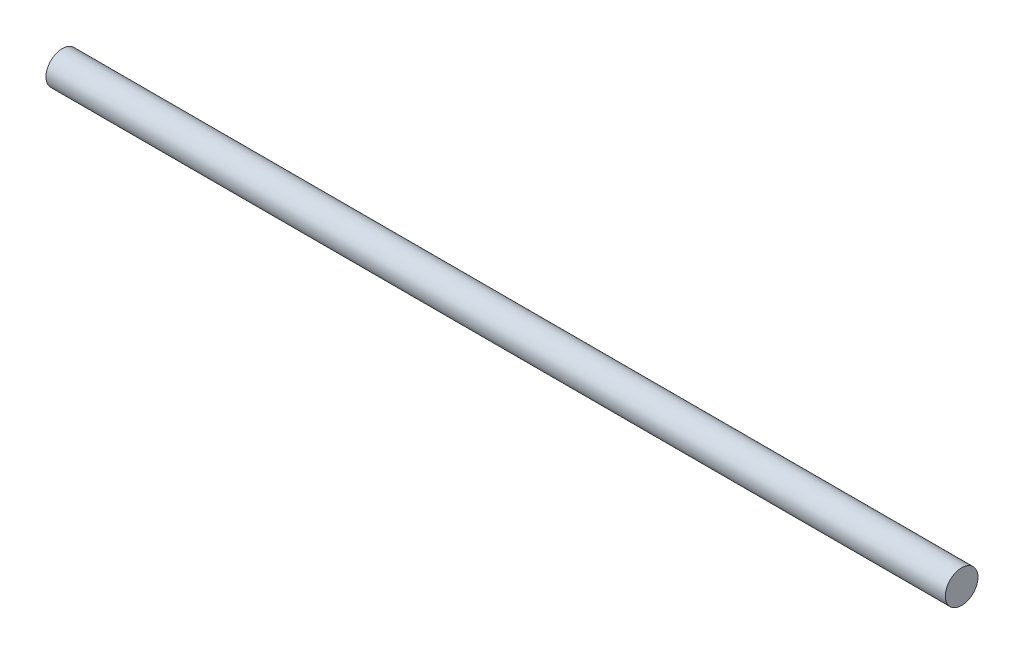
ISO-10303-21;
HEADER;
FILE_DESCRIPTION(('STEP AP214'),'2;1');
FILE_NAME('part.step','',(''),(''),'','','');
FILE_SCHEMA(('AUTOMOTIVE_DESIGN { 1 0 10303 214 1 1 1 1 }'));
ENDSEC;
DATA;
#1=APPLICATION_CONTEXT('core data for automotive mechanical design processes');
#2=APPLICATION_PROTOCOL_DEFINITION('international standard','automotive_design',2000,#1);
#3=PRODUCT_CONTEXT('',#1,'mechanical');
#4=PRODUCT('Part','Part','',(#3));
#5=PRODUCT_RELATED_PRODUCT_CATEGORY('part','',(#4));
#6=PRODUCT_DEFINITION_FORMATION('','',#4);
#7=PRODUCT_DEFINITION_CONTEXT('part definition',#1,'design');
#8=PRODUCT_DEFINITION('design','',#6,#7);
#9=PRODUCT_DEFINITION_SHAPE('','',#8);
#10=(LENGTH_UNIT() NAMED_UNIT(*) SI_UNIT(.MILLI.,.METRE.));
#11=(NAMED_UNIT(*) PLANE_ANGLE_UNIT() SI_UNIT($,.RADIAN.));
#12=(NAMED_UNIT(*) SI_UNIT($,.STERADIAN.) SOLID_ANGLE_UNIT());
#13=UNCERTAINTY_MEASURE_WITH_UNIT(LENGTH_MEASURE(1.E-05),#10,'distance_accuracy_value','');
#14=(GEOMETRIC_REPRESENTATION_CONTEXT(3) GLOBAL_UNCERTAINTY_ASSIGNED_CONTEXT((#13)) GLOBAL_UNIT_ASSIGNED_CONTEXT((#10,
#11,#12)) REPRESENTATION_CONTEXT('',''));
#15=CARTESIAN_POINT('',(0.,0.,0.));
#16=DIRECTION('',(0.,0.,1.));
#17=DIRECTION('',(1.,0.,0.));
#18=AXIS2_PLACEMENT_3D('',#15,#16,#17);
#19=CARTESIAN_POINT('',(-13.75,0.,0.));
#20=DIRECTION('',(1.,0.,0.));
#21=DIRECTION('',(0.,0.,-1.));
#22=AXIS2_PLACEMENT_3D('',#19,#20,#21);
#23=CYLINDRICAL_SURFACE('',#22,0.5);
#24=CARTESIAN_POINT('',(-13.75,0.,0.));
#25=DIRECTION('',(1.,0.,0.));
#26=DIRECTION('',(0.,0.,-1.));
#27=AXIS2_PLACEMENT_3D('',#24,#25,#26);
#28=CIRCLE('',#27,0.5);
#29=CARTESIAN_POINT('',(-13.75,0.,-0.5));
#30=VERTEX_POINT('',#29);
#31=EDGE_CURVE('E10',#30,#30,#28,.T.);
#32=ORIENTED_EDGE('',*,*,#31,.T.);
#33=EDGE_LOOP('',(#32));
#34=FACE_BOUND('',#33,.T.);
#35=CARTESIAN_POINT('',(13.75,0.,0.));
#36=DIRECTION('',(1.,0.,0.));
#37=DIRECTION('',(0.,0.,-1.));
#38=AXIS2_PLACEMENT_3D('',#35,#36,#37);
#39=CIRCLE('',#38,0.5);
#40=CARTESIAN_POINT('',(13.75,0.,-0.5));
#41=VERTEX_POINT('',#40);
#42=EDGE_CURVE('E37',#41,#41,#39,.T.);
#43=ORIENTED_EDGE('',*,*,#42,.F.);
#44=EDGE_LOOP('',(#43));
#45=FACE_BOUND('',#44,.T.);
#46=ADVANCED_FACE('F31',(#34,#45),#23,.T.);
#47=CARTESIAN_POINT('',(-13.75,0.,0.));
#48=DIRECTION('',(1.,0.,0.));
#49=DIRECTION('',(0.,0.,-1.));
#50=AXIS2_PLACEMENT_3D('',#47,#48,#49);
#51=PLANE('',#50);
#52=ORIENTED_EDGE('',*,*,#31,.F.);
#53=EDGE_LOOP('',(#52));
#54=FACE_BOUND('',#53,.T.);
#55=ADVANCED_FACE('F46',(#54),#51,.F.);
#56=CARTESIAN_POINT('',(13.75,0.,0.));
#57=DIRECTION('',(1.,0.,0.));
#58=DIRECTION('',(0.,0.,-1.));
#59=AXIS2_PLACEMENT_3D('',#56,#57,#58);
#60=PLANE('',#59);
#61=ORIENTED_EDGE('',*,*,#42,.T.);
#62=EDGE_LOOP('',(#61));
#63=FACE_BOUND('',#62,.T.);
#64=ADVANCED_FACE('F43',(#63),#60,.T.);
#65=CLOSED_SHELL('',(#46,#55,#64));
#66=MANIFOLD_SOLID_BREP('B2',#65);
#67=ADVANCED_BREP_SHAPE_REPRESENTATION('',(#18,#66),#14);
#68=SHAPE_DEFINITION_REPRESENTATION(#9,#67);
ENDSEC;
END-ISO-10303-21;
